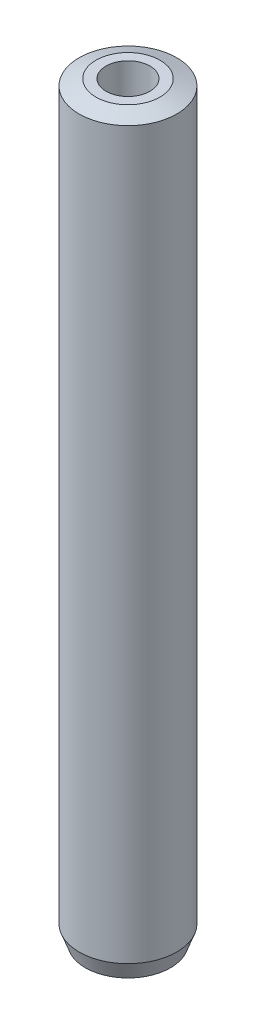
ISO-10303-21;
HEADER;
FILE_DESCRIPTION(('STEP AP214'),'2;1');
FILE_NAME('part.step','',(''),(''),'','','');
FILE_SCHEMA(('AUTOMOTIVE_DESIGN { 1 0 10303 214 1 1 1 1 }'));
ENDSEC;
DATA;
#1=APPLICATION_CONTEXT('core data for automotive mechanical design processes');
#2=APPLICATION_PROTOCOL_DEFINITION('international standard','automotive_design',2000,#1);
#3=PRODUCT_CONTEXT('',#1,'mechanical');
#4=PRODUCT('Part','Part','',(#3));
#5=PRODUCT_RELATED_PRODUCT_CATEGORY('part','',(#4));
#6=PRODUCT_DEFINITION_FORMATION('','',#4);
#7=PRODUCT_DEFINITION_CONTEXT('part definition',#1,'design');
#8=PRODUCT_DEFINITION('design','',#6,#7);
#9=PRODUCT_DEFINITION_SHAPE('','',#8);
#10=(LENGTH_UNIT() NAMED_UNIT(*) SI_UNIT(.MILLI.,.METRE.));
#11=(NAMED_UNIT(*) PLANE_ANGLE_UNIT() SI_UNIT($,.RADIAN.));
#12=(NAMED_UNIT(*) SI_UNIT($,.STERADIAN.) SOLID_ANGLE_UNIT());
#13=UNCERTAINTY_MEASURE_WITH_UNIT(LENGTH_MEASURE(1.E-05),#10,'distance_accuracy_value','');
#14=(GEOMETRIC_REPRESENTATION_CONTEXT(3) GLOBAL_UNCERTAINTY_ASSIGNED_CONTEXT((#13)) GLOBAL_UNIT_ASSIGNED_CONTEXT((#10,
#11,#12)) REPRESENTATION_CONTEXT('',''));
#15=CARTESIAN_POINT('',(0.,0.,0.));
#16=DIRECTION('',(0.,0.,1.));
#17=DIRECTION('',(1.,0.,0.));
#18=AXIS2_PLACEMENT_3D('',#15,#16,#17);
#19=CARTESIAN_POINT('',(0.,345.192541881492,0.));
#20=DIRECTION('',(0.,-1.,0.));
#21=DIRECTION('',(0.,0.,-1.));
#22=AXIS2_PLACEMENT_3D('',#19,#20,#21);
#23=CYLINDRICAL_SURFACE('',#22,22.5);
#24=CARTESIAN_POINT('',(0.,342.317500080121,0.));
#25=DIRECTION('',(0.,1.,0.));
#26=DIRECTION('',(0.,0.,1.));
#27=AXIS2_PLACEMENT_3D('',#24,#25,#26);
#28=CIRCLE('',#27,22.5);
#29=CARTESIAN_POINT('',(0.,342.317500080121,22.5));
#30=VERTEX_POINT('',#29);
#31=EDGE_CURVE('E50',#30,#30,#28,.F.);
#32=ORIENTED_EDGE('',*,*,#31,.T.);
#33=EDGE_LOOP('',(#32));
#34=FACE_BOUND('',#33,.T.);
#35=CARTESIAN_POINT('',(0.,7.7463798008679,0.));
#36=DIRECTION('',(0.,1.,0.));
#37=DIRECTION('',(0.,0.,1.));
#38=AXIS2_PLACEMENT_3D('',#35,#36,#37);
#39=CIRCLE('',#38,22.5);
#40=CARTESIAN_POINT('',(0.,7.7463798008679,22.5));
#41=VERTEX_POINT('',#40);
#42=EDGE_CURVE('E51',#41,#41,#39,.T.);
#43=ORIENTED_EDGE('',*,*,#42,.T.);
#44=EDGE_LOOP('',(#43));
#45=FACE_BOUND('',#44,.T.);
#46=ADVANCED_FACE('F39',(#34,#45),#23,.T.);
#47=CARTESIAN_POINT('',(0.,345.192541881492,0.));
#48=DIRECTION('',(0.,1.,0.));
#49=DIRECTION('',(0.,0.,1.));
#50=AXIS2_PLACEMENT_3D('',#47,#48,#49);
#51=PLANE('',#50);
#52=CARTESIAN_POINT('',(0.,345.192541881492,0.));
#53=DIRECTION('',(0.,1.,0.));
#54=DIRECTION('',(0.,0.,1.));
#55=AXIS2_PLACEMENT_3D('',#52,#53,#54);
#56=CIRCLE('',#55,14.7536201991323);
#57=CARTESIAN_POINT('',(0.,345.192541881492,14.7536201991323));
#58=VERTEX_POINT('',#57);
#59=EDGE_CURVE('E54',#58,#58,#56,.T.);
#60=ORIENTED_EDGE('',*,*,#59,.T.);
#61=EDGE_LOOP('',(#60));
#62=FACE_BOUND('',#61,.T.);
#63=CARTESIAN_POINT('',(0.,345.192541881492,0.));
#64=DIRECTION('',(0.,1.,0.));
#65=DIRECTION('',(0.,0.,1.));
#66=AXIS2_PLACEMENT_3D('',#63,#64,#65);
#67=CIRCLE('',#66,10.1086068792259);
#68=CARTESIAN_POINT('',(0.,345.192541881492,10.1086068792259));
#69=VERTEX_POINT('',#68);
#70=EDGE_CURVE('E58',#69,#69,#67,.T.);
#71=ORIENTED_EDGE('',*,*,#70,.F.);
#72=EDGE_LOOP('',(#71));
#73=FACE_BOUND('',#72,.T.);
#74=ADVANCED_FACE('F69',(#62,#73),#51,.T.);
#75=CARTESIAN_POINT('',(0.,0.,0.));
#76=DIRECTION('',(0.,1.,0.));
#77=DIRECTION('',(0.,0.,1.));
#78=AXIS2_PLACEMENT_3D('',#75,#76,#77);
#79=PLANE('',#78);
#80=CARTESIAN_POINT('',(0.,0.,0.));
#81=DIRECTION('',(0.,1.,0.));
#82=DIRECTION('',(0.,0.,1.));
#83=AXIS2_PLACEMENT_3D('',#80,#81,#82);
#84=CIRCLE('',#83,19.6249581986293);
#85=CARTESIAN_POINT('',(0.,0.,19.6249581986293));
#86=VERTEX_POINT('',#85);
#87=EDGE_CURVE('E10',#86,#86,#84,.F.);
#88=ORIENTED_EDGE('',*,*,#87,.T.);
#89=EDGE_LOOP('',(#88));
#90=FACE_BOUND('',#89,.T.);
#91=CARTESIAN_POINT('',(0.,0.,0.));
#92=DIRECTION('',(0.,1.,0.));
#93=DIRECTION('',(0.,0.,1.));
#94=AXIS2_PLACEMENT_3D('',#91,#92,#93);
#95=CIRCLE('',#94,10.1086068792259);
#96=CARTESIAN_POINT('',(0.,0.,10.1086068792259));
#97=VERTEX_POINT('',#96);
#98=EDGE_CURVE('E63',#97,#97,#95,.T.);
#99=ORIENTED_EDGE('',*,*,#98,.T.);
#100=EDGE_LOOP('',(#99));
#101=FACE_BOUND('',#100,.T.);
#102=ADVANCED_FACE('F75',(#90,#101),#79,.F.);
#103=CARTESIAN_POINT('',(0.,345.192541881492,0.));
#104=DIRECTION('',(0.,-1.,0.));
#105=DIRECTION('',(0.,0.,-1.));
#106=AXIS2_PLACEMENT_3D('',#103,#104,#105);
#107=CYLINDRICAL_SURFACE('',#106,10.1086068792259);
#108=ORIENTED_EDGE('',*,*,#70,.T.);
#109=EDGE_LOOP('',(#108));
#110=FACE_BOUND('',#109,.T.);
#111=ORIENTED_EDGE('',*,*,#98,.F.);
#112=EDGE_LOOP('',(#111));
#113=FACE_BOUND('',#112,.T.);
#114=ADVANCED_FACE('F70',(#110,#113),#107,.F.);
#115=CARTESIAN_POINT('',(0.,345.192541881492,0.));
#116=DIRECTION('',(0.,-1.,0.));
#117=DIRECTION('',(0.,0.,-1.));
#118=AXIS2_PLACEMENT_3D('',#115,#116,#117);
#119=CONICAL_SURFACE('',#118,14.7536201991323,1.21540833439098);
#120=ORIENTED_EDGE('',*,*,#31,.F.);
#121=EDGE_LOOP('',(#120));
#122=FACE_BOUND('',#121,.T.);
#123=ORIENTED_EDGE('',*,*,#59,.F.);
#124=EDGE_LOOP('',(#123));
#125=FACE_BOUND('',#124,.T.);
#126=ADVANCED_FACE('F81',(#122,#125),#119,.T.);
#127=CARTESIAN_POINT('',(0.,7.7463798008679,0.));
#128=DIRECTION('',(0.,1.,0.));
#129=DIRECTION('',(0.,0.,1.));
#130=AXIS2_PLACEMENT_3D('',#127,#128,#129);
#131=CONICAL_SURFACE('',#130,22.5,0.355387992403919);
#132=ORIENTED_EDGE('',*,*,#87,.F.);
#133=EDGE_LOOP('',(#132));
#134=FACE_BOUND('',#133,.T.);
#135=ORIENTED_EDGE('',*,*,#42,.F.);
#136=EDGE_LOOP('',(#135));
#137=FACE_BOUND('',#136,.T.);
#138=ADVANCED_FACE('F45',(#134,#137),#131,.T.);
#139=CLOSED_SHELL('',(#46,#74,#102,#114,#126,#138));
#140=MANIFOLD_SOLID_BREP('B2',#139);
#141=ADVANCED_BREP_SHAPE_REPRESENTATION('',(#18,#140),#14);
#142=SHAPE_DEFINITION_REPRESENTATION(#9,#141);
ENDSEC;
END-ISO-10303-21;
